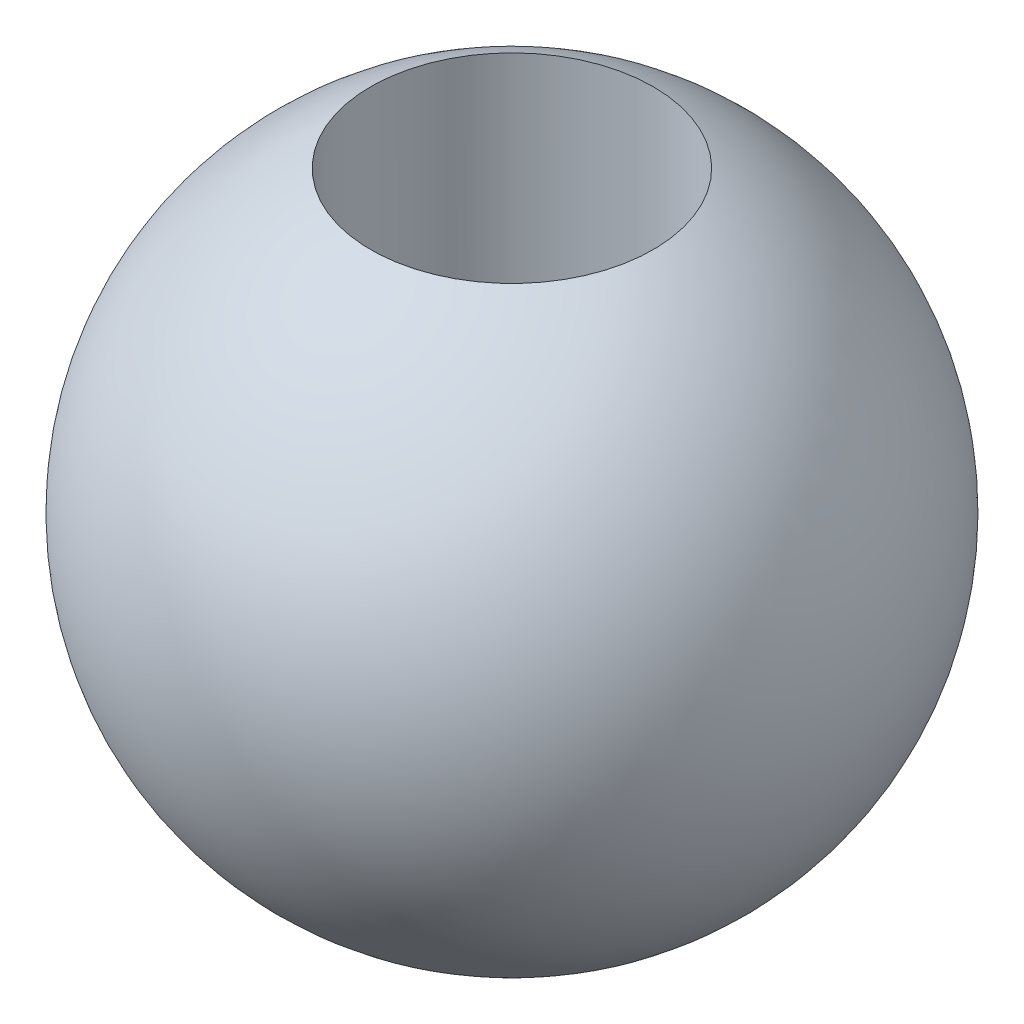
ISO-10303-21;
HEADER;
FILE_DESCRIPTION(('STEP AP214'),'2;1');
FILE_NAME('part.step','',(''),(''),'','','');
FILE_SCHEMA(('AUTOMOTIVE_DESIGN { 1 0 10303 214 1 1 1 1 }'));
ENDSEC;
DATA;
#1=APPLICATION_CONTEXT('core data for automotive mechanical design processes');
#2=APPLICATION_PROTOCOL_DEFINITION('international standard','automotive_design',2000,#1);
#3=PRODUCT_CONTEXT('',#1,'mechanical');
#4=PRODUCT('Part','Part','',(#3));
#5=PRODUCT_RELATED_PRODUCT_CATEGORY('part','',(#4));
#6=PRODUCT_DEFINITION_FORMATION('','',#4);
#7=PRODUCT_DEFINITION_CONTEXT('part definition',#1,'design');
#8=PRODUCT_DEFINITION('design','',#6,#7);
#9=PRODUCT_DEFINITION_SHAPE('','',#8);
#10=(LENGTH_UNIT() NAMED_UNIT(*) SI_UNIT(.MILLI.,.METRE.));
#11=(NAMED_UNIT(*) PLANE_ANGLE_UNIT() SI_UNIT($,.RADIAN.));
#12=(NAMED_UNIT(*) SI_UNIT($,.STERADIAN.) SOLID_ANGLE_UNIT());
#13=UNCERTAINTY_MEASURE_WITH_UNIT(LENGTH_MEASURE(1.E-05),#10,'distance_accuracy_value','');
#14=(GEOMETRIC_REPRESENTATION_CONTEXT(3) GLOBAL_UNCERTAINTY_ASSIGNED_CONTEXT((#13)) GLOBAL_UNIT_ASSIGNED_CONTEXT((#10,
#11,#12)) REPRESENTATION_CONTEXT('',''));
#15=CARTESIAN_POINT('',(0.,0.,0.));
#16=DIRECTION('',(0.,0.,1.));
#17=DIRECTION('',(1.,0.,0.));
#18=AXIS2_PLACEMENT_3D('',#15,#16,#17);
#19=CARTESIAN_POINT('',(0.,0.,0.));
#20=DIRECTION('',(0.,-1.,0.));
#21=DIRECTION('',(-1.,0.,0.));
#22=AXIS2_PLACEMENT_3D('',#19,#20,#21);
#23=SPHERICAL_SURFACE('',#22,7.);
#24=CARTESIAN_POINT('',(0.,6.32455532033676,0.));
#25=DIRECTION('',(0.,-1.,0.));
#26=DIRECTION('',(0.,0.,-1.));
#27=AXIS2_PLACEMENT_3D('',#24,#25,#26);
#28=CIRCLE('',#27,3.);
#29=CARTESIAN_POINT('',(0.,6.32455532033676,-3.));
#30=VERTEX_POINT('',#29);
#31=EDGE_CURVE('E10',#30,#30,#28,.T.);
#32=ORIENTED_EDGE('',*,*,#31,.T.);
#33=EDGE_LOOP('',(#32));
#34=FACE_BOUND('',#33,.T.);
#35=CARTESIAN_POINT('',(0.,-6.32455532033676,0.));
#36=DIRECTION('',(0.,1.,0.));
#37=DIRECTION('',(0.,0.,1.));
#38=AXIS2_PLACEMENT_3D('',#35,#36,#37);
#39=CIRCLE('',#38,3.);
#40=CARTESIAN_POINT('',(0.,-6.32455532033676,3.));
#41=VERTEX_POINT('',#40);
#42=EDGE_CURVE('E42',#41,#41,#39,.T.);
#43=ORIENTED_EDGE('',*,*,#42,.T.);
#44=EDGE_LOOP('',(#43));
#45=FACE_BOUND('',#44,.T.);
#46=ADVANCED_FACE('F36',(#34,#45),#23,.T.);
#47=CARTESIAN_POINT('',(0.,-7.,0.));
#48=DIRECTION('',(0.,1.,0.));
#49=DIRECTION('',(0.,0.,1.));
#50=AXIS2_PLACEMENT_3D('',#47,#48,#49);
#51=CYLINDRICAL_SURFACE('',#50,3.);
#52=ORIENTED_EDGE('',*,*,#42,.F.);
#53=EDGE_LOOP('',(#52));
#54=FACE_BOUND('',#53,.T.);
#55=ORIENTED_EDGE('',*,*,#31,.F.);
#56=EDGE_LOOP('',(#55));
#57=FACE_BOUND('',#56,.T.);
#58=ADVANCED_FACE('F49',(#54,#57),#51,.F.);
#59=CLOSED_SHELL('',(#46,#58));
#60=MANIFOLD_SOLID_BREP('B2',#59);
#61=ADVANCED_BREP_SHAPE_REPRESENTATION('',(#18,#60),#14);
#62=SHAPE_DEFINITION_REPRESENTATION(#9,#61);
ENDSEC;
END-ISO-10303-21;
